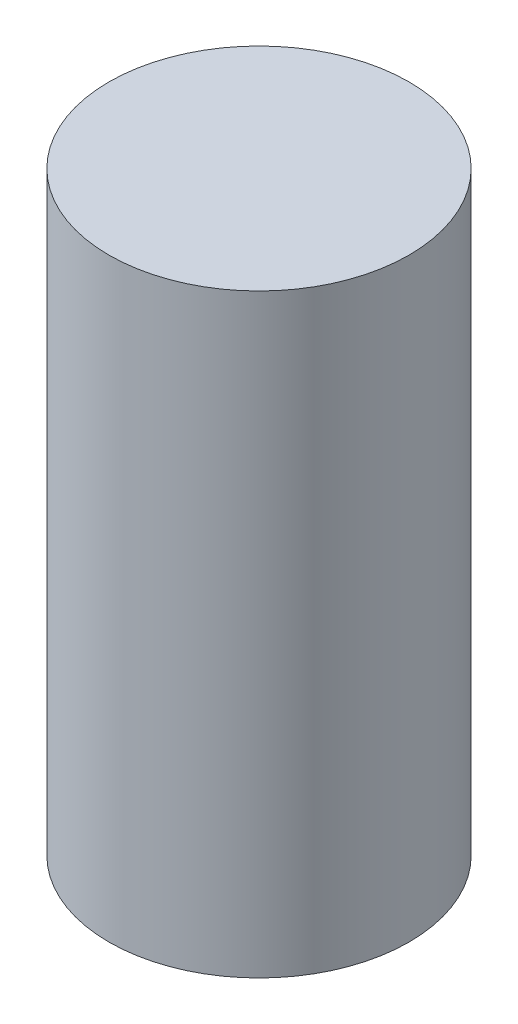
ISO-10303-21;
HEADER;
FILE_DESCRIPTION(('STEP AP214'),'2;1');
FILE_NAME('part.step','',(''),(''),'','','');
FILE_SCHEMA(('AUTOMOTIVE_DESIGN { 1 0 10303 214 1 1 1 1 }'));
ENDSEC;
DATA;
#1=APPLICATION_CONTEXT('core data for automotive mechanical design processes');
#2=APPLICATION_PROTOCOL_DEFINITION('international standard','automotive_design',2000,#1);
#3=PRODUCT_CONTEXT('',#1,'mechanical');
#4=PRODUCT('Part','Part','',(#3));
#5=PRODUCT_RELATED_PRODUCT_CATEGORY('part','',(#4));
#6=PRODUCT_DEFINITION_FORMATION('','',#4);
#7=PRODUCT_DEFINITION_CONTEXT('part definition',#1,'design');
#8=PRODUCT_DEFINITION('design','',#6,#7);
#9=PRODUCT_DEFINITION_SHAPE('','',#8);
#10=(LENGTH_UNIT() NAMED_UNIT(*) SI_UNIT(.MILLI.,.METRE.));
#11=(NAMED_UNIT(*) PLANE_ANGLE_UNIT() SI_UNIT($,.RADIAN.));
#12=(NAMED_UNIT(*) SI_UNIT($,.STERADIAN.) SOLID_ANGLE_UNIT());
#13=UNCERTAINTY_MEASURE_WITH_UNIT(LENGTH_MEASURE(1.E-05),#10,'distance_accuracy_value','');
#14=(GEOMETRIC_REPRESENTATION_CONTEXT(3) GLOBAL_UNCERTAINTY_ASSIGNED_CONTEXT((#13)) GLOBAL_UNIT_ASSIGNED_CONTEXT((#10,
#11,#12)) REPRESENTATION_CONTEXT('',''));
#15=CARTESIAN_POINT('',(0.,0.,0.));
#16=DIRECTION('',(0.,0.,1.));
#17=DIRECTION('',(1.,0.,0.));
#18=AXIS2_PLACEMENT_3D('',#15,#16,#17);
#19=CARTESIAN_POINT('',(0.,11.5,0.));
#20=DIRECTION('',(0.,-1.,0.));
#21=DIRECTION('',(0.,0.,-1.));
#22=AXIS2_PLACEMENT_3D('',#19,#20,#21);
#23=CYLINDRICAL_SURFACE('',#22,2.9);
#24=CARTESIAN_POINT('',(0.,11.5,0.));
#25=DIRECTION('',(0.,1.,0.));
#26=DIRECTION('',(0.,0.,1.));
#27=AXIS2_PLACEMENT_3D('',#24,#25,#26);
#28=CIRCLE('',#27,2.9);
#29=CARTESIAN_POINT('',(0.,11.5,2.9));
#30=VERTEX_POINT('',#29);
#31=EDGE_CURVE('E10',#30,#30,#28,.T.);
#32=ORIENTED_EDGE('',*,*,#31,.F.);
#33=EDGE_LOOP('',(#32));
#34=FACE_BOUND('',#33,.T.);
#35=CARTESIAN_POINT('',(0.,0.,0.));
#36=DIRECTION('',(0.,1.,0.));
#37=DIRECTION('',(0.,0.,1.));
#38=AXIS2_PLACEMENT_3D('',#35,#36,#37);
#39=CIRCLE('',#38,2.9);
#40=CARTESIAN_POINT('',(0.,0.,2.9));
#41=VERTEX_POINT('',#40);
#42=EDGE_CURVE('E36',#41,#41,#39,.T.);
#43=ORIENTED_EDGE('',*,*,#42,.T.);
#44=EDGE_LOOP('',(#43));
#45=FACE_BOUND('',#44,.T.);
#46=ADVANCED_FACE('F33',(#34,#45),#23,.T.);
#47=CARTESIAN_POINT('',(0.,11.5,0.));
#48=DIRECTION('',(0.,1.,0.));
#49=DIRECTION('',(0.,0.,1.));
#50=AXIS2_PLACEMENT_3D('',#47,#48,#49);
#51=PLANE('',#50);
#52=ORIENTED_EDGE('',*,*,#31,.T.);
#53=EDGE_LOOP('',(#52));
#54=FACE_BOUND('',#53,.T.);
#55=ADVANCED_FACE('F48',(#54),#51,.T.);
#56=CARTESIAN_POINT('',(0.,0.,0.));
#57=DIRECTION('',(0.,1.,0.));
#58=DIRECTION('',(0.,0.,1.));
#59=AXIS2_PLACEMENT_3D('',#56,#57,#58);
#60=PLANE('',#59);
#61=ORIENTED_EDGE('',*,*,#42,.F.);
#62=EDGE_LOOP('',(#61));
#63=FACE_BOUND('',#62,.T.);
#64=ADVANCED_FACE('F46',(#63),#60,.F.);
#65=CLOSED_SHELL('',(#46,#55,#64));
#66=MANIFOLD_SOLID_BREP('B2',#65);
#67=ADVANCED_BREP_SHAPE_REPRESENTATION('',(#18,#66),#14);
#68=SHAPE_DEFINITION_REPRESENTATION(#9,#67);
ENDSEC;
END-ISO-10303-21;
